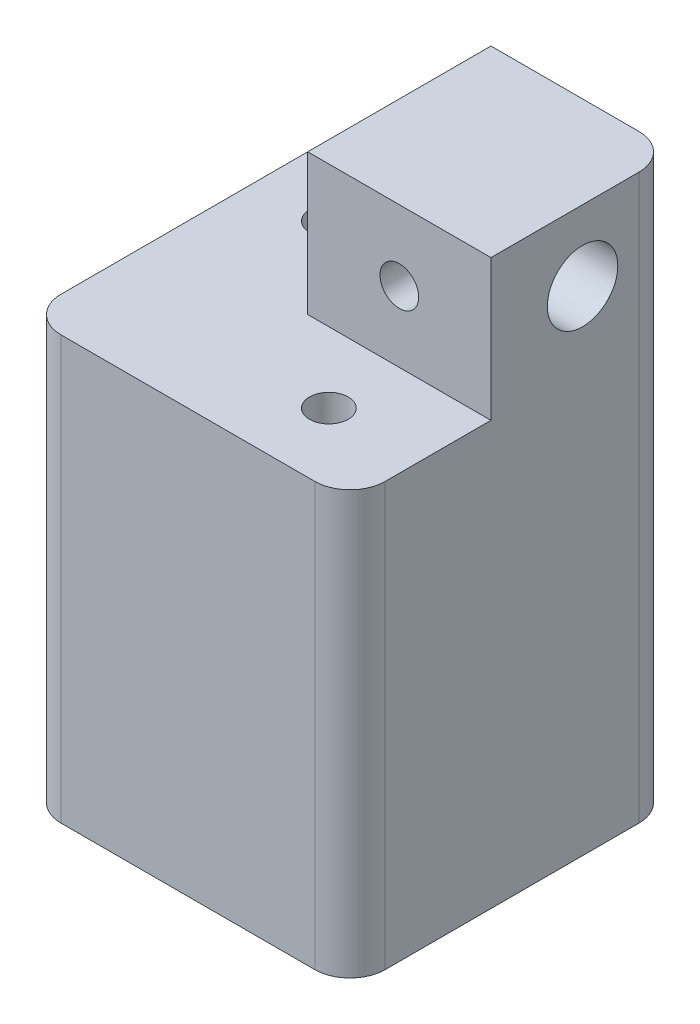
ISO-10303-21;
HEADER;
FILE_DESCRIPTION(('STEP AP214'),'2;1');
FILE_NAME('part.step','',(''),(''),'','','');
FILE_SCHEMA(('AUTOMOTIVE_DESIGN { 1 0 10303 214 1 1 1 1 }'));
ENDSEC;
DATA;
#1=APPLICATION_CONTEXT('core data for automotive mechanical design processes');
#2=APPLICATION_PROTOCOL_DEFINITION('international standard','automotive_design',2000,#1);
#3=PRODUCT_CONTEXT('',#1,'mechanical');
#4=PRODUCT('Part','Part','',(#3));
#5=PRODUCT_RELATED_PRODUCT_CATEGORY('part','',(#4));
#6=PRODUCT_DEFINITION_FORMATION('','',#4);
#7=PRODUCT_DEFINITION_CONTEXT('part definition',#1,'design');
#8=PRODUCT_DEFINITION('design','',#6,#7);
#9=PRODUCT_DEFINITION_SHAPE('','',#8);
#10=(LENGTH_UNIT() NAMED_UNIT(*) SI_UNIT(.MILLI.,.METRE.));
#11=(NAMED_UNIT(*) PLANE_ANGLE_UNIT() SI_UNIT($,.RADIAN.));
#12=(NAMED_UNIT(*) SI_UNIT($,.STERADIAN.) SOLID_ANGLE_UNIT());
#13=UNCERTAINTY_MEASURE_WITH_UNIT(LENGTH_MEASURE(1.E-05),#10,'distance_accuracy_value','');
#14=(GEOMETRIC_REPRESENTATION_CONTEXT(3) GLOBAL_UNCERTAINTY_ASSIGNED_CONTEXT((#13)) GLOBAL_UNIT_ASSIGNED_CONTEXT((#10,
#11,#12)) REPRESENTATION_CONTEXT('',''));
#15=CARTESIAN_POINT('',(0.,0.,0.));
#16=DIRECTION('',(0.,0.,1.));
#17=DIRECTION('',(1.,0.,0.));
#18=AXIS2_PLACEMENT_3D('',#15,#16,#17);
#19=CARTESIAN_POINT('',(10.,80.,-33.));
#20=DIRECTION('',(0.,-1.,0.));
#21=DIRECTION('',(0.,0.,-1.));
#22=AXIS2_PLACEMENT_3D('',#19,#20,#21);
#23=CYLINDRICAL_SURFACE('',#22,2.75);
#24=CARTESIAN_POINT('',(10.,60.,-33.));
#25=DIRECTION('',(0.,1.,0.));
#26=DIRECTION('',(0.,0.,1.));
#27=AXIS2_PLACEMENT_3D('',#24,#25,#26);
#28=CIRCLE('',#27,2.75);
#29=CARTESIAN_POINT('',(10.,60.,-30.25));
#30=VERTEX_POINT('',#29);
#31=EDGE_CURVE('E156',#30,#30,#28,.T.);
#32=ORIENTED_EDGE('',*,*,#31,.T.);
#33=EDGE_LOOP('',(#32));
#34=FACE_BOUND('',#33,.T.);
#35=CARTESIAN_POINT('',(10.,55.,-33.));
#36=DIRECTION('',(0.,-1.,0.));
#37=DIRECTION('',(0.,0.,-1.));
#38=AXIS2_PLACEMENT_3D('',#35,#36,#37);
#39=CIRCLE('',#38,2.75);
#40=CARTESIAN_POINT('',(10.,55.,-35.75));
#41=VERTEX_POINT('',#40);
#42=EDGE_CURVE('E36',#41,#41,#39,.F.);
#43=ORIENTED_EDGE('',*,*,#42,.F.);
#44=EDGE_LOOP('',(#43));
#45=FACE_BOUND('',#44,.T.);
#46=ADVANCED_FACE('F32',(#34,#45),#23,.F.);
#47=CARTESIAN_POINT('',(33.,0.,-10.));
#48=DIRECTION('',(0.,1.,0.));
#49=DIRECTION('',(0.,0.,1.));
#50=AXIS2_PLACEMENT_3D('',#47,#48,#49);
#51=CYLINDRICAL_SURFACE('',#50,2.75);
#52=CARTESIAN_POINT('',(33.,60.,-10.));
#53=DIRECTION('',(0.,1.,0.));
#54=DIRECTION('',(0.,0.,1.));
#55=AXIS2_PLACEMENT_3D('',#52,#53,#54);
#56=CIRCLE('',#55,2.75);
#57=CARTESIAN_POINT('',(33.,60.,-7.25));
#58=VERTEX_POINT('',#57);
#59=EDGE_CURVE('E188',#58,#58,#56,.T.);
#60=ORIENTED_EDGE('',*,*,#59,.T.);
#61=EDGE_LOOP('',(#60));
#62=FACE_BOUND('',#61,.T.);
#63=CARTESIAN_POINT('',(33.,55.,-10.));
#64=DIRECTION('',(0.,-1.,0.));
#65=DIRECTION('',(0.,0.,-1.));
#66=AXIS2_PLACEMENT_3D('',#63,#64,#65);
#67=CIRCLE('',#66,2.75);
#68=CARTESIAN_POINT('',(33.,55.,-12.75));
#69=VERTEX_POINT('',#68);
#70=EDGE_CURVE('E189',#69,#69,#67,.F.);
#71=ORIENTED_EDGE('',*,*,#70,.F.);
#72=EDGE_LOOP('',(#71));
#73=FACE_BOUND('',#72,.T.);
#74=ADVANCED_FACE('F328',(#62,#73),#51,.F.);
#75=CARTESIAN_POINT('',(25.,70.,-33.));
#76=DIRECTION('',(1.,0.,0.));
#77=DIRECTION('',(0.,0.,-1.));
#78=AXIS2_PLACEMENT_3D('',#75,#76,#77);
#79=CYLINDRICAL_SURFACE('',#78,4.99999999999999);
#80=CARTESIAN_POINT('',(46.,70.,-33.));
#81=DIRECTION('',(1.,0.,0.));
#82=DIRECTION('',(0.,0.,-1.));
#83=AXIS2_PLACEMENT_3D('',#80,#81,#82);
#84=CIRCLE('',#83,4.99999999999999);
#85=CARTESIAN_POINT('',(46.,70.,-38.));
#86=VERTEX_POINT('',#85);
#87=EDGE_CURVE('E219',#86,#86,#84,.T.);
#88=ORIENTED_EDGE('',*,*,#87,.T.);
#89=EDGE_LOOP('',(#88));
#90=FACE_BOUND('',#89,.T.);
#91=CARTESIAN_POINT('',(33.,70.,-33.));
#92=DIRECTION('',(0.707106781186547,0.,0.707106781186547));
#93=DIRECTION('',(0.707106781186547,0.,-0.707106781186547));
#94=AXIS2_PLACEMENT_3D('',#91,#92,#93);
#95=ELLIPSE('',#94,7.07106781186547,5.);
#96=CARTESIAN_POINT('',(33.,75.,-33.));
#97=VERTEX_POINT('',#96);
#98=CARTESIAN_POINT('',(33.,65.,-33.));
#99=VERTEX_POINT('',#98);
#100=EDGE_CURVE('E133',#97,#99,#95,.F.);
#101=ORIENTED_EDGE('',*,*,#100,.T.);
#102=CARTESIAN_POINT('',(33.,70.,-33.));
#103=DIRECTION('',(0.707106781186547,0.,-0.707106781186547));
#104=DIRECTION('',(0.707106781186547,0.,0.707106781186547));
#105=AXIS2_PLACEMENT_3D('',#102,#103,#104);
#106=ELLIPSE('',#105,7.07106781186547,5.);
#107=EDGE_CURVE('E129',#99,#97,#106,.F.);
#108=ORIENTED_EDGE('',*,*,#107,.T.);
#109=EDGE_LOOP('',(#101,#108));
#110=FACE_BOUND('',#109,.T.);
#111=ADVANCED_FACE('F141',(#90,#110),#79,.F.);
#112=CARTESIAN_POINT('',(0.,80.,0.));
#113=DIRECTION('',(1.,0.,0.));
#114=DIRECTION('',(0.,0.,-1.));
#115=AXIS2_PLACEMENT_3D('',#112,#113,#114);
#116=PLANE('',#115);
#117=DIRECTION('',(0.,0.,1.));
#118=VECTOR('',#117,1.);
#119=CARTESIAN_POINT('',(0.,60.,-46.));
#120=LINE('',#119,#118);
#121=CARTESIAN_POINT('',(0.,60.,-41.));
#122=VERTEX_POINT('',#121);
#123=CARTESIAN_POINT('',(0.,60.,-5.));
#124=VERTEX_POINT('',#123);
#125=EDGE_CURVE('E228',#122,#124,#120,.T.);
#126=ORIENTED_EDGE('',*,*,#125,.F.);
#127=DIRECTION('',(0.,-1.,0.));
#128=VECTOR('',#127,1.);
#129=CARTESIAN_POINT('',(0.,80.,-41.));
#130=LINE('',#129,#128);
#131=CARTESIAN_POINT('',(0.,0.,-41.));
#132=VERTEX_POINT('',#131);
#133=EDGE_CURVE('E158',#122,#132,#130,.T.);
#134=ORIENTED_EDGE('',*,*,#133,.T.);
#135=DIRECTION('',(0.,0.,1.));
#136=VECTOR('',#135,1.);
#137=CARTESIAN_POINT('',(0.,0.,0.));
#138=LINE('',#137,#136);
#139=CARTESIAN_POINT('',(0.,0.,-5.));
#140=VERTEX_POINT('',#139);
#141=EDGE_CURVE('E253',#132,#140,#138,.T.);
#142=ORIENTED_EDGE('',*,*,#141,.T.);
#143=DIRECTION('',(0.,-1.,0.));
#144=VECTOR('',#143,1.);
#145=CARTESIAN_POINT('',(0.,80.,-5.));
#146=LINE('',#145,#144);
#147=EDGE_CURVE('E142',#140,#124,#146,.F.);
#148=ORIENTED_EDGE('',*,*,#147,.T.);
#149=EDGE_LOOP('',(#126,#134,#142,#148));
#150=FACE_BOUND('',#149,.T.);
#151=ADVANCED_FACE('F285',(#150),#116,.F.);
#152=CARTESIAN_POINT('',(0.,80.,0.));
#153=DIRECTION('',(0.,0.,-1.));
#154=DIRECTION('',(-1.,0.,0.));
#155=AXIS2_PLACEMENT_3D('',#152,#153,#154);
#156=PLANE('',#155);
#157=DIRECTION('',(1.,0.,0.));
#158=VECTOR('',#157,1.);
#159=CARTESIAN_POINT('',(0.,60.,0.));
#160=LINE('',#159,#158);
#161=CARTESIAN_POINT('',(5.,60.,0.));
#162=VERTEX_POINT('',#161);
#163=CARTESIAN_POINT('',(41.,60.,0.));
#164=VERTEX_POINT('',#163);
#165=EDGE_CURVE('E231',#162,#164,#160,.T.);
#166=ORIENTED_EDGE('',*,*,#165,.F.);
#167=DIRECTION('',(0.,-1.,0.));
#168=VECTOR('',#167,1.);
#169=CARTESIAN_POINT('',(5.,80.,0.));
#170=LINE('',#169,#168);
#171=CARTESIAN_POINT('',(5.,0.,0.));
#172=VERTEX_POINT('',#171);
#173=EDGE_CURVE('E181',#162,#172,#170,.T.);
#174=ORIENTED_EDGE('',*,*,#173,.T.);
#175=DIRECTION('',(1.,0.,0.));
#176=VECTOR('',#175,1.);
#177=CARTESIAN_POINT('',(0.,0.,0.));
#178=LINE('',#177,#176);
#179=CARTESIAN_POINT('',(41.,0.,0.));
#180=VERTEX_POINT('',#179);
#181=EDGE_CURVE('E263',#172,#180,#178,.T.);
#182=ORIENTED_EDGE('',*,*,#181,.T.);
#183=DIRECTION('',(0.,-1.,0.));
#184=VECTOR('',#183,1.);
#185=CARTESIAN_POINT('',(41.,80.,0.));
#186=LINE('',#185,#184);
#187=EDGE_CURVE('E179',#180,#164,#186,.F.);
#188=ORIENTED_EDGE('',*,*,#187,.T.);
#189=EDGE_LOOP('',(#166,#174,#182,#188));
#190=FACE_BOUND('',#189,.T.);
#191=ADVANCED_FACE('F293',(#190),#156,.F.);
#192=CARTESIAN_POINT('',(46.,80.,0.));
#193=DIRECTION('',(-1.,0.,0.));
#194=DIRECTION('',(0.,0.,1.));
#195=AXIS2_PLACEMENT_3D('',#192,#193,#194);
#196=PLANE('',#195);
#197=ORIENTED_EDGE('',*,*,#87,.F.);
#198=EDGE_LOOP('',(#197));
#199=FACE_BOUND('',#198,.T.);
#200=DIRECTION('',(0.,0.,-1.));
#201=VECTOR('',#200,1.);
#202=CARTESIAN_POINT('',(46.,60.,0.));
#203=LINE('',#202,#201);
#204=CARTESIAN_POINT('',(46.,60.,-5.));
#205=VERTEX_POINT('',#204);
#206=CARTESIAN_POINT('',(46.,60.,-20.));
#207=VERTEX_POINT('',#206);
#208=EDGE_CURVE('E234',#205,#207,#203,.T.);
#209=ORIENTED_EDGE('',*,*,#208,.F.);
#210=DIRECTION('',(0.,-1.,0.));
#211=VECTOR('',#210,1.);
#212=CARTESIAN_POINT('',(46.,80.,-5.));
#213=LINE('',#212,#211);
#214=CARTESIAN_POINT('',(46.,0.,-5.));
#215=VERTEX_POINT('',#214);
#216=EDGE_CURVE('E41',#205,#215,#213,.T.);
#217=ORIENTED_EDGE('',*,*,#216,.T.);
#218=DIRECTION('',(0.,0.,-1.));
#219=VECTOR('',#218,1.);
#220=CARTESIAN_POINT('',(46.,0.,0.));
#221=LINE('',#220,#219);
#222=CARTESIAN_POINT('',(46.,0.,-41.));
#223=VERTEX_POINT('',#222);
#224=EDGE_CURVE('E266',#215,#223,#221,.T.);
#225=ORIENTED_EDGE('',*,*,#224,.T.);
#226=DIRECTION('',(0.,-1.,0.));
#227=VECTOR('',#226,1.);
#228=CARTESIAN_POINT('',(46.,80.,-41.));
#229=LINE('',#228,#227);
#230=CARTESIAN_POINT('',(46.,80.,-41.));
#231=VERTEX_POINT('',#230);
#232=EDGE_CURVE('E49',#223,#231,#229,.F.);
#233=ORIENTED_EDGE('',*,*,#232,.T.);
#234=DIRECTION('',(0.,0.,-1.));
#235=VECTOR('',#234,1.);
#236=CARTESIAN_POINT('',(46.,80.,0.));
#237=LINE('',#236,#235);
#238=CARTESIAN_POINT('',(46.,80.,-20.));
#239=VERTEX_POINT('',#238);
#240=EDGE_CURVE('E257',#239,#231,#237,.T.);
#241=ORIENTED_EDGE('',*,*,#240,.F.);
#242=DIRECTION('',(0.,1.,0.));
#243=VECTOR('',#242,1.);
#244=CARTESIAN_POINT('',(46.,60.,-20.));
#245=LINE('',#244,#243);
#246=EDGE_CURVE('E245',#207,#239,#245,.T.);
#247=ORIENTED_EDGE('',*,*,#246,.F.);
#248=EDGE_LOOP('',(#209,#217,#225,#233,#241,#247));
#249=FACE_BOUND('',#248,.T.);
#250=ADVANCED_FACE('F300',(#199,#249),#196,.F.);
#251=CARTESIAN_POINT('',(0.,80.,-46.));
#252=DIRECTION('',(0.,0.,1.));
#253=DIRECTION('',(1.,0.,0.));
#254=AXIS2_PLACEMENT_3D('',#251,#252,#253);
#255=PLANE('',#254);
#256=CARTESIAN_POINT('',(33.,70.,-46.));
#257=DIRECTION('',(0.,0.,-1.));
#258=DIRECTION('',(-1.,0.,0.));
#259=AXIS2_PLACEMENT_3D('',#256,#257,#258);
#260=CIRCLE('',#259,5.);
#261=CARTESIAN_POINT('',(28.,70.,-46.));
#262=VERTEX_POINT('',#261);
#263=EDGE_CURVE('E215',#262,#262,#260,.T.);
#264=ORIENTED_EDGE('',*,*,#263,.F.);
#265=EDGE_LOOP('',(#264));
#266=FACE_BOUND('',#265,.T.);
#267=DIRECTION('',(-1.,0.,0.));
#268=VECTOR('',#267,1.);
#269=CARTESIAN_POINT('',(0.,0.,-46.));
#270=LINE('',#269,#268);
#271=CARTESIAN_POINT('',(41.,0.,-46.));
#272=VERTEX_POINT('',#271);
#273=CARTESIAN_POINT('',(4.99999999999999,0.,-46.));
#274=VERTEX_POINT('',#273);
#275=EDGE_CURVE('E259',#272,#274,#270,.T.);
#276=ORIENTED_EDGE('',*,*,#275,.T.);
#277=DIRECTION('',(0.,-1.,0.));
#278=VECTOR('',#277,1.);
#279=CARTESIAN_POINT('',(4.99999999999999,80.,-46.));
#280=LINE('',#279,#278);
#281=CARTESIAN_POINT('',(4.99999999999999,60.,-46.));
#282=VERTEX_POINT('',#281);
#283=EDGE_CURVE('E172',#274,#282,#280,.F.);
#284=ORIENTED_EDGE('',*,*,#283,.T.);
#285=DIRECTION('',(-1.,0.,0.));
#286=VECTOR('',#285,1.);
#287=CARTESIAN_POINT('',(0.,60.,-46.));
#288=LINE('',#287,#286);
#289=CARTESIAN_POINT('',(20.,60.,-46.));
#290=VERTEX_POINT('',#289);
#291=EDGE_CURVE('E242',#290,#282,#288,.T.);
#292=ORIENTED_EDGE('',*,*,#291,.F.);
#293=DIRECTION('',(0.,1.,0.));
#294=VECTOR('',#293,1.);
#295=CARTESIAN_POINT('',(20.,60.,-46.));
#296=LINE('',#295,#294);
#297=CARTESIAN_POINT('',(20.,80.,-46.));
#298=VERTEX_POINT('',#297);
#299=EDGE_CURVE('E250',#290,#298,#296,.T.);
#300=ORIENTED_EDGE('',*,*,#299,.T.);
#301=DIRECTION('',(-1.,0.,0.));
#302=VECTOR('',#301,1.);
#303=CARTESIAN_POINT('',(0.,80.,-46.));
#304=LINE('',#303,#302);
#305=CARTESIAN_POINT('',(41.,80.,-46.));
#306=VERTEX_POINT('',#305);
#307=EDGE_CURVE('E139',#306,#298,#304,.T.);
#308=ORIENTED_EDGE('',*,*,#307,.F.);
#309=DIRECTION('',(0.,-1.,0.));
#310=VECTOR('',#309,1.);
#311=CARTESIAN_POINT('',(41.,80.,-46.));
#312=LINE('',#311,#310);
#313=EDGE_CURVE('E169',#306,#272,#312,.T.);
#314=ORIENTED_EDGE('',*,*,#313,.T.);
#315=EDGE_LOOP('',(#276,#284,#292,#300,#308,#314));
#316=FACE_BOUND('',#315,.T.);
#317=ADVANCED_FACE('F272',(#266,#316),#255,.F.);
#318=CARTESIAN_POINT('',(0.,80.,0.));
#319=DIRECTION('',(0.,-1.,0.));
#320=DIRECTION('',(0.,0.,-1.));
#321=AXIS2_PLACEMENT_3D('',#318,#319,#320);
#322=PLANE('',#321);
#323=ORIENTED_EDGE('',*,*,#240,.T.);
#324=CARTESIAN_POINT('',(41.,80.,-41.));
#325=DIRECTION('',(0.,-1.,0.));
#326=DIRECTION('',(0.,0.,-1.));
#327=AXIS2_PLACEMENT_3D('',#324,#325,#326);
#328=CIRCLE('',#327,5.);
#329=EDGE_CURVE('E11',#231,#306,#328,.F.);
#330=ORIENTED_EDGE('',*,*,#329,.T.);
#331=ORIENTED_EDGE('',*,*,#307,.T.);
#332=DIRECTION('',(0.,0.,-1.));
#333=VECTOR('',#332,1.);
#334=CARTESIAN_POINT('',(20.,80.,-46.));
#335=LINE('',#334,#333);
#336=CARTESIAN_POINT('',(20.,80.,-20.));
#337=VERTEX_POINT('',#336);
#338=EDGE_CURVE('E232',#337,#298,#335,.T.);
#339=ORIENTED_EDGE('',*,*,#338,.F.);
#340=DIRECTION('',(-1.,0.,0.));
#341=VECTOR('',#340,1.);
#342=CARTESIAN_POINT('',(20.,80.,-20.));
#343=LINE('',#342,#341);
#344=EDGE_CURVE('E225',#239,#337,#343,.T.);
#345=ORIENTED_EDGE('',*,*,#344,.F.);
#346=EDGE_LOOP('',(#323,#330,#331,#339,#345));
#347=FACE_BOUND('',#346,.T.);
#348=ADVANCED_FACE('F306',(#347),#322,.F.);
#349=CARTESIAN_POINT('',(0.,0.,0.));
#350=DIRECTION('',(0.,-1.,0.));
#351=DIRECTION('',(0.,0.,-1.));
#352=AXIS2_PLACEMENT_3D('',#349,#350,#351);
#353=PLANE('',#352);
#354=CARTESIAN_POINT('',(33.,0.,-10.));
#355=DIRECTION('',(0.,-1.,0.));
#356=DIRECTION('',(0.,0.,-1.));
#357=AXIS2_PLACEMENT_3D('',#354,#355,#356);
#358=CIRCLE('',#357,5.);
#359=CARTESIAN_POINT('',(33.,0.,-15.));
#360=VERTEX_POINT('',#359);
#361=EDGE_CURVE('E196',#360,#360,#358,.T.);
#362=ORIENTED_EDGE('',*,*,#361,.F.);
#363=EDGE_LOOP('',(#362));
#364=FACE_BOUND('',#363,.T.);
#365=CARTESIAN_POINT('',(10.,0.,-33.));
#366=DIRECTION('',(0.,-1.,0.));
#367=DIRECTION('',(0.,0.,-1.));
#368=AXIS2_PLACEMENT_3D('',#365,#366,#367);
#369=CIRCLE('',#368,5.);
#370=CARTESIAN_POINT('',(10.,0.,-38.));
#371=VERTEX_POINT('',#370);
#372=EDGE_CURVE('E206',#371,#371,#369,.T.);
#373=ORIENTED_EDGE('',*,*,#372,.F.);
#374=EDGE_LOOP('',(#373));
#375=FACE_BOUND('',#374,.T.);
#376=ORIENTED_EDGE('',*,*,#141,.F.);
#377=CARTESIAN_POINT('',(4.99999999999999,0.,-41.));
#378=DIRECTION('',(0.,-1.,0.));
#379=DIRECTION('',(0.,0.,-1.));
#380=AXIS2_PLACEMENT_3D('',#377,#378,#379);
#381=CIRCLE('',#380,5.);
#382=EDGE_CURVE('E167',#132,#274,#381,.T.);
#383=ORIENTED_EDGE('',*,*,#382,.T.);
#384=ORIENTED_EDGE('',*,*,#275,.F.);
#385=CARTESIAN_POINT('',(41.,0.,-41.));
#386=DIRECTION('',(0.,-1.,0.));
#387=DIRECTION('',(0.,0.,-1.));
#388=AXIS2_PLACEMENT_3D('',#385,#386,#387);
#389=CIRCLE('',#388,5.);
#390=EDGE_CURVE('E161',#272,#223,#389,.T.);
#391=ORIENTED_EDGE('',*,*,#390,.T.);
#392=ORIENTED_EDGE('',*,*,#224,.F.);
#393=CARTESIAN_POINT('',(41.,0.,-5.));
#394=DIRECTION('',(0.,-1.,0.));
#395=DIRECTION('',(0.,0.,-1.));
#396=AXIS2_PLACEMENT_3D('',#393,#394,#395);
#397=CIRCLE('',#396,5.);
#398=EDGE_CURVE('E163',#215,#180,#397,.T.);
#399=ORIENTED_EDGE('',*,*,#398,.T.);
#400=ORIENTED_EDGE('',*,*,#181,.F.);
#401=CARTESIAN_POINT('',(5.,0.,-5.));
#402=DIRECTION('',(0.,-1.,0.));
#403=DIRECTION('',(0.,0.,-1.));
#404=AXIS2_PLACEMENT_3D('',#401,#402,#403);
#405=CIRCLE('',#404,5.);
#406=EDGE_CURVE('E165',#172,#140,#405,.T.);
#407=ORIENTED_EDGE('',*,*,#406,.T.);
#408=EDGE_LOOP('',(#376,#383,#384,#391,#392,#399,#400,#407));
#409=FACE_BOUND('',#408,.T.);
#410=ADVANCED_FACE('F302',(#364,#375,#409),#353,.T.);
#411=CARTESIAN_POINT('',(20.,60.,-46.));
#412=DIRECTION('',(1.,0.,0.));
#413=DIRECTION('',(0.,0.,-1.));
#414=AXIS2_PLACEMENT_3D('',#411,#412,#413);
#415=PLANE('',#414);
#416=CARTESIAN_POINT('',(20.,70.,-33.));
#417=DIRECTION('',(1.,0.,0.));
#418=DIRECTION('',(0.,0.,-1.));
#419=AXIS2_PLACEMENT_3D('',#416,#417,#418);
#420=CIRCLE('',#419,2.75);
#421=CARTESIAN_POINT('',(20.,70.,-35.75));
#422=VERTEX_POINT('',#421);
#423=EDGE_CURVE('E152',#422,#422,#420,.T.);
#424=ORIENTED_EDGE('',*,*,#423,.T.);
#425=EDGE_LOOP('',(#424));
#426=FACE_BOUND('',#425,.T.);
#427=ORIENTED_EDGE('',*,*,#338,.T.);
#428=ORIENTED_EDGE('',*,*,#299,.F.);
#429=DIRECTION('',(0.,0.,-1.));
#430=VECTOR('',#429,1.);
#431=CARTESIAN_POINT('',(20.,60.,-46.));
#432=LINE('',#431,#430);
#433=CARTESIAN_POINT('',(20.,60.,-20.));
#434=VERTEX_POINT('',#433);
#435=EDGE_CURVE('E239',#434,#290,#432,.T.);
#436=ORIENTED_EDGE('',*,*,#435,.F.);
#437=DIRECTION('',(0.,1.,0.));
#438=VECTOR('',#437,1.);
#439=CARTESIAN_POINT('',(20.,60.,-20.));
#440=LINE('',#439,#438);
#441=EDGE_CURVE('E254',#434,#337,#440,.T.);
#442=ORIENTED_EDGE('',*,*,#441,.T.);
#443=EDGE_LOOP('',(#427,#428,#436,#442));
#444=FACE_BOUND('',#443,.T.);
#445=ADVANCED_FACE('F311',(#426,#444),#415,.F.);
#446=CARTESIAN_POINT('',(20.,60.,-20.));
#447=DIRECTION('',(0.,0.,-1.));
#448=DIRECTION('',(-1.,0.,0.));
#449=AXIS2_PLACEMENT_3D('',#446,#447,#448);
#450=PLANE('',#449);
#451=CARTESIAN_POINT('',(33.,70.,-20.));
#452=DIRECTION('',(0.,0.,-1.));
#453=DIRECTION('',(-1.,0.,0.));
#454=AXIS2_PLACEMENT_3D('',#451,#452,#453);
#455=CIRCLE('',#454,2.75);
#456=CARTESIAN_POINT('',(30.25,70.,-20.));
#457=VERTEX_POINT('',#456);
#458=EDGE_CURVE('E151',#457,#457,#455,.T.);
#459=ORIENTED_EDGE('',*,*,#458,.T.);
#460=EDGE_LOOP('',(#459));
#461=FACE_BOUND('',#460,.T.);
#462=ORIENTED_EDGE('',*,*,#344,.T.);
#463=ORIENTED_EDGE('',*,*,#441,.F.);
#464=DIRECTION('',(-1.,0.,0.));
#465=VECTOR('',#464,1.);
#466=CARTESIAN_POINT('',(20.,60.,-20.));
#467=LINE('',#466,#465);
#468=EDGE_CURVE('E236',#207,#434,#467,.T.);
#469=ORIENTED_EDGE('',*,*,#468,.F.);
#470=ORIENTED_EDGE('',*,*,#246,.T.);
#471=EDGE_LOOP('',(#462,#463,#469,#470));
#472=FACE_BOUND('',#471,.T.);
#473=ADVANCED_FACE('F314',(#461,#472),#450,.F.);
#474=CARTESIAN_POINT('',(0.,60.,0.));
#475=DIRECTION('',(0.,1.,0.));
#476=DIRECTION('',(0.,0.,1.));
#477=AXIS2_PLACEMENT_3D('',#474,#475,#476);
#478=PLANE('',#477);
#479=ORIENTED_EDGE('',*,*,#59,.F.);
#480=EDGE_LOOP('',(#479));
#481=FACE_BOUND('',#480,.T.);
#482=ORIENTED_EDGE('',*,*,#31,.F.);
#483=EDGE_LOOP('',(#482));
#484=FACE_BOUND('',#483,.T.);
#485=ORIENTED_EDGE('',*,*,#291,.T.);
#486=CARTESIAN_POINT('',(4.99999999999999,60.,-41.));
#487=DIRECTION('',(0.,1.,0.));
#488=DIRECTION('',(0.,0.,1.));
#489=AXIS2_PLACEMENT_3D('',#486,#487,#488);
#490=CIRCLE('',#489,5.);
#491=EDGE_CURVE('E177',#282,#122,#490,.T.);
#492=ORIENTED_EDGE('',*,*,#491,.T.);
#493=ORIENTED_EDGE('',*,*,#125,.T.);
#494=CARTESIAN_POINT('',(5.,60.,-5.));
#495=DIRECTION('',(0.,1.,0.));
#496=DIRECTION('',(0.,0.,1.));
#497=AXIS2_PLACEMENT_3D('',#494,#495,#496);
#498=CIRCLE('',#497,5.);
#499=EDGE_CURVE('E175',#124,#162,#498,.T.);
#500=ORIENTED_EDGE('',*,*,#499,.T.);
#501=ORIENTED_EDGE('',*,*,#165,.T.);
#502=CARTESIAN_POINT('',(41.,60.,-5.));
#503=DIRECTION('',(0.,1.,0.));
#504=DIRECTION('',(0.,0.,1.));
#505=AXIS2_PLACEMENT_3D('',#502,#503,#504);
#506=CIRCLE('',#505,5.);
#507=EDGE_CURVE('E57',#164,#205,#506,.T.);
#508=ORIENTED_EDGE('',*,*,#507,.T.);
#509=ORIENTED_EDGE('',*,*,#208,.T.);
#510=ORIENTED_EDGE('',*,*,#468,.T.);
#511=ORIENTED_EDGE('',*,*,#435,.T.);
#512=EDGE_LOOP('',(#485,#492,#493,#500,#501,#508,#509,#510,#511));
#513=FACE_BOUND('',#512,.T.);
#514=ADVANCED_FACE('F282',(#481,#484,#513),#478,.T.);
#515=CARTESIAN_POINT('',(33.,70.,-25.));
#516=DIRECTION('',(0.,0.,-1.));
#517=DIRECTION('',(-1.,0.,0.));
#518=AXIS2_PLACEMENT_3D('',#515,#516,#517);
#519=CYLINDRICAL_SURFACE('',#518,5.);
#520=ORIENTED_EDGE('',*,*,#263,.T.);
#521=EDGE_LOOP('',(#520));
#522=FACE_BOUND('',#521,.T.);
#523=ORIENTED_EDGE('',*,*,#100,.F.);
#524=CARTESIAN_POINT('',(33.,70.,-33.));
#525=DIRECTION('',(0.707106781186547,0.,-0.707106781186547));
#526=DIRECTION('',(0.707106781186547,0.,0.707106781186547));
#527=AXIS2_PLACEMENT_3D('',#524,#525,#526);
#528=ELLIPSE('',#527,7.07106781186547,5.);
#529=EDGE_CURVE('E132',#99,#97,#528,.T.);
#530=ORIENTED_EDGE('',*,*,#529,.F.);
#531=EDGE_LOOP('',(#523,#530));
#532=FACE_BOUND('',#531,.T.);
#533=ADVANCED_FACE('F137',(#522,#532),#519,.F.);
#534=CARTESIAN_POINT('',(25.,70.,-33.));
#535=DIRECTION('',(1.,0.,0.));
#536=DIRECTION('',(0.,0.,-1.));
#537=AXIS2_PLACEMENT_3D('',#534,#535,#536);
#538=PLANE('',#537);
#539=CARTESIAN_POINT('',(25.,70.,-33.));
#540=DIRECTION('',(1.,0.,0.));
#541=DIRECTION('',(0.,0.,-1.));
#542=AXIS2_PLACEMENT_3D('',#539,#540,#541);
#543=CIRCLE('',#542,2.75);
#544=CARTESIAN_POINT('',(25.,70.,-35.75));
#545=VERTEX_POINT('',#544);
#546=EDGE_CURVE('E153',#545,#545,#543,.T.);
#547=ORIENTED_EDGE('',*,*,#546,.F.);
#548=EDGE_LOOP('',(#547));
#549=FACE_BOUND('',#548,.T.);
#550=CARTESIAN_POINT('',(25.,70.,-33.));
#551=DIRECTION('',(1.,0.,0.));
#552=DIRECTION('',(0.,0.,-1.));
#553=AXIS2_PLACEMENT_3D('',#550,#551,#552);
#554=CIRCLE('',#553,4.99999999999999);
#555=CARTESIAN_POINT('',(25.,70.,-38.));
#556=VERTEX_POINT('',#555);
#557=EDGE_CURVE('E222',#556,#556,#554,.T.);
#558=ORIENTED_EDGE('',*,*,#557,.T.);
#559=EDGE_LOOP('',(#558));
#560=FACE_BOUND('',#559,.T.);
#561=ADVANCED_FACE('F354',(#549,#560),#538,.T.);
#562=CARTESIAN_POINT('',(33.,70.,-33.));
#563=DIRECTION('',(0.707106781186547,0.,0.707106781186547));
#564=DIRECTION('',(0.707106781186547,0.,-0.707106781186547));
#565=AXIS2_PLACEMENT_3D('',#562,#563,#564);
#566=ELLIPSE('',#565,7.07106781186547,5.);
#567=EDGE_CURVE('E125',#97,#99,#566,.T.);
#568=ORIENTED_EDGE('',*,*,#567,.T.);
#569=ORIENTED_EDGE('',*,*,#529,.T.);
#570=EDGE_LOOP('',(#568,#569));
#571=FACE_BOUND('',#570,.T.);
#572=ORIENTED_EDGE('',*,*,#557,.F.);
#573=EDGE_LOOP('',(#572));
#574=FACE_BOUND('',#573,.T.);
#575=ADVANCED_FACE('F144',(#571,#574),#79,.F.);
#576=CARTESIAN_POINT('',(33.,70.,-25.));
#577=DIRECTION('',(0.,0.,-1.));
#578=DIRECTION('',(-1.,0.,0.));
#579=AXIS2_PLACEMENT_3D('',#576,#577,#578);
#580=CIRCLE('',#579,5.);
#581=CARTESIAN_POINT('',(28.,70.,-25.));
#582=VERTEX_POINT('',#581);
#583=EDGE_CURVE('E216',#582,#582,#580,.T.);
#584=ORIENTED_EDGE('',*,*,#583,.F.);
#585=EDGE_LOOP('',(#584));
#586=FACE_BOUND('',#585,.T.);
#587=ORIENTED_EDGE('',*,*,#567,.F.);
#588=ORIENTED_EDGE('',*,*,#107,.F.);
#589=EDGE_LOOP('',(#587,#588));
#590=FACE_BOUND('',#589,.T.);
#591=ADVANCED_FACE('F127',(#586,#590),#519,.F.);
#592=CARTESIAN_POINT('',(33.,70.,-25.));
#593=DIRECTION('',(0.,0.,-1.));
#594=DIRECTION('',(-1.,0.,0.));
#595=AXIS2_PLACEMENT_3D('',#592,#593,#594);
#596=PLANE('',#595);
#597=CARTESIAN_POINT('',(33.,70.,-25.));
#598=DIRECTION('',(0.,0.,-1.));
#599=DIRECTION('',(-1.,0.,0.));
#600=AXIS2_PLACEMENT_3D('',#597,#598,#599);
#601=CIRCLE('',#600,2.75);
#602=CARTESIAN_POINT('',(30.25,70.,-25.));
#603=VERTEX_POINT('',#602);
#604=EDGE_CURVE('E148',#603,#603,#601,.T.);
#605=ORIENTED_EDGE('',*,*,#604,.F.);
#606=EDGE_LOOP('',(#605));
#607=FACE_BOUND('',#606,.T.);
#608=ORIENTED_EDGE('',*,*,#583,.T.);
#609=EDGE_LOOP('',(#608));
#610=FACE_BOUND('',#609,.T.);
#611=ADVANCED_FACE('F346',(#607,#610),#596,.T.);
#612=CARTESIAN_POINT('',(33.,70.,0.));
#613=DIRECTION('',(0.,0.,-1.));
#614=DIRECTION('',(-1.,0.,0.));
#615=AXIS2_PLACEMENT_3D('',#612,#613,#614);
#616=CYLINDRICAL_SURFACE('',#615,2.75);
#617=ORIENTED_EDGE('',*,*,#604,.T.);
#618=EDGE_LOOP('',(#617));
#619=FACE_BOUND('',#618,.T.);
#620=ORIENTED_EDGE('',*,*,#458,.F.);
#621=EDGE_LOOP('',(#620));
#622=FACE_BOUND('',#621,.T.);
#623=ADVANCED_FACE('F342',(#619,#622),#616,.F.);
#624=CARTESIAN_POINT('',(0.,70.,-33.));
#625=DIRECTION('',(1.,0.,0.));
#626=DIRECTION('',(0.,0.,-1.));
#627=AXIS2_PLACEMENT_3D('',#624,#625,#626);
#628=CYLINDRICAL_SURFACE('',#627,2.75);
#629=ORIENTED_EDGE('',*,*,#546,.T.);
#630=EDGE_LOOP('',(#629));
#631=FACE_BOUND('',#630,.T.);
#632=ORIENTED_EDGE('',*,*,#423,.F.);
#633=EDGE_LOOP('',(#632));
#634=FACE_BOUND('',#633,.T.);
#635=ADVANCED_FACE('F339',(#631,#634),#628,.F.);
#636=CARTESIAN_POINT('',(4.99999999999999,80.,-41.));
#637=DIRECTION('',(0.,-1.,0.));
#638=DIRECTION('',(0.,0.,-1.));
#639=AXIS2_PLACEMENT_3D('',#636,#637,#638);
#640=CYLINDRICAL_SURFACE('',#639,5.);
#641=ORIENTED_EDGE('',*,*,#491,.F.);
#642=ORIENTED_EDGE('',*,*,#283,.F.);
#643=ORIENTED_EDGE('',*,*,#382,.F.);
#644=ORIENTED_EDGE('',*,*,#133,.F.);
#645=EDGE_LOOP('',(#641,#642,#643,#644));
#646=FACE_BOUND('',#645,.T.);
#647=ADVANCED_FACE('F279',(#646),#640,.T.);
#648=CARTESIAN_POINT('',(5.,80.,-5.));
#649=DIRECTION('',(0.,-1.,0.));
#650=DIRECTION('',(0.,0.,-1.));
#651=AXIS2_PLACEMENT_3D('',#648,#649,#650);
#652=CYLINDRICAL_SURFACE('',#651,5.);
#653=ORIENTED_EDGE('',*,*,#499,.F.);
#654=ORIENTED_EDGE('',*,*,#147,.F.);
#655=ORIENTED_EDGE('',*,*,#406,.F.);
#656=ORIENTED_EDGE('',*,*,#173,.F.);
#657=EDGE_LOOP('',(#653,#654,#655,#656));
#658=FACE_BOUND('',#657,.T.);
#659=ADVANCED_FACE('F289',(#658),#652,.T.);
#660=CARTESIAN_POINT('',(41.,80.,-5.));
#661=DIRECTION('',(0.,-1.,0.));
#662=DIRECTION('',(0.,0.,-1.));
#663=AXIS2_PLACEMENT_3D('',#660,#661,#662);
#664=CYLINDRICAL_SURFACE('',#663,5.);
#665=ORIENTED_EDGE('',*,*,#507,.F.);
#666=ORIENTED_EDGE('',*,*,#187,.F.);
#667=ORIENTED_EDGE('',*,*,#398,.F.);
#668=ORIENTED_EDGE('',*,*,#216,.F.);
#669=EDGE_LOOP('',(#665,#666,#667,#668));
#670=FACE_BOUND('',#669,.T.);
#671=ADVANCED_FACE('F297',(#670),#664,.T.);
#672=CARTESIAN_POINT('',(41.,80.,-41.));
#673=DIRECTION('',(0.,-1.,0.));
#674=DIRECTION('',(0.,0.,-1.));
#675=AXIS2_PLACEMENT_3D('',#672,#673,#674);
#676=CYLINDRICAL_SURFACE('',#675,5.);
#677=ORIENTED_EDGE('',*,*,#329,.F.);
#678=ORIENTED_EDGE('',*,*,#232,.F.);
#679=ORIENTED_EDGE('',*,*,#390,.F.);
#680=ORIENTED_EDGE('',*,*,#313,.F.);
#681=EDGE_LOOP('',(#677,#678,#679,#680));
#682=FACE_BOUND('',#681,.T.);
#683=ADVANCED_FACE('F34',(#682),#676,.T.);
#684=CARTESIAN_POINT('',(33.,55.,-10.));
#685=DIRECTION('',(0.,-1.,0.));
#686=DIRECTION('',(0.,0.,-1.));
#687=AXIS2_PLACEMENT_3D('',#684,#685,#686);
#688=PLANE('',#687);
#689=CARTESIAN_POINT('',(33.,55.,-10.));
#690=DIRECTION('',(0.,-1.,0.));
#691=DIRECTION('',(0.,0.,-1.));
#692=AXIS2_PLACEMENT_3D('',#689,#690,#691);
#693=CIRCLE('',#692,5.);
#694=CARTESIAN_POINT('',(33.,55.,-15.));
#695=VERTEX_POINT('',#694);
#696=EDGE_CURVE('E191',#695,#695,#693,.T.);
#697=ORIENTED_EDGE('',*,*,#696,.T.);
#698=EDGE_LOOP('',(#697));
#699=FACE_BOUND('',#698,.T.);
#700=ORIENTED_EDGE('',*,*,#70,.T.);
#701=EDGE_LOOP('',(#700));
#702=FACE_BOUND('',#701,.T.);
#703=ADVANCED_FACE('F387',(#699,#702),#688,.T.);
#704=CARTESIAN_POINT('',(33.,55.,-10.));
#705=DIRECTION('',(0.,-1.,0.));
#706=DIRECTION('',(0.,0.,-1.));
#707=AXIS2_PLACEMENT_3D('',#704,#705,#706);
#708=CYLINDRICAL_SURFACE('',#707,5.);
#709=ORIENTED_EDGE('',*,*,#696,.F.);
#710=EDGE_LOOP('',(#709));
#711=FACE_BOUND('',#710,.T.);
#712=ORIENTED_EDGE('',*,*,#361,.T.);
#713=EDGE_LOOP('',(#712));
#714=FACE_BOUND('',#713,.T.);
#715=ADVANCED_FACE('F391',(#711,#714),#708,.F.);
#716=CARTESIAN_POINT('',(10.,55.,-33.));
#717=DIRECTION('',(0.,-1.,0.));
#718=DIRECTION('',(0.,0.,-1.));
#719=AXIS2_PLACEMENT_3D('',#716,#717,#718);
#720=PLANE('',#719);
#721=CARTESIAN_POINT('',(10.,55.,-33.));
#722=DIRECTION('',(0.,-1.,0.));
#723=DIRECTION('',(0.,0.,-1.));
#724=AXIS2_PLACEMENT_3D('',#721,#722,#723);
#725=CIRCLE('',#724,5.);
#726=CARTESIAN_POINT('',(10.,55.,-38.));
#727=VERTEX_POINT('',#726);
#728=EDGE_CURVE('E201',#727,#727,#725,.T.);
#729=ORIENTED_EDGE('',*,*,#728,.T.);
#730=EDGE_LOOP('',(#729));
#731=FACE_BOUND('',#730,.T.);
#732=ORIENTED_EDGE('',*,*,#42,.T.);
#733=EDGE_LOOP('',(#732));
#734=FACE_BOUND('',#733,.T.);
#735=ADVANCED_FACE('F396',(#731,#734),#720,.T.);
#736=CARTESIAN_POINT('',(10.,55.,-33.));
#737=DIRECTION('',(0.,-1.,0.));
#738=DIRECTION('',(0.,0.,-1.));
#739=AXIS2_PLACEMENT_3D('',#736,#737,#738);
#740=CYLINDRICAL_SURFACE('',#739,5.);
#741=ORIENTED_EDGE('',*,*,#728,.F.);
#742=EDGE_LOOP('',(#741));
#743=FACE_BOUND('',#742,.T.);
#744=ORIENTED_EDGE('',*,*,#372,.T.);
#745=EDGE_LOOP('',(#744));
#746=FACE_BOUND('',#745,.T.);
#747=ADVANCED_FACE('F401',(#743,#746),#740,.F.);
#748=CLOSED_SHELL('',(#46,#74,#111,#151,#191,#250,#317,#348,#410,#445,#473,#514,#533,#561,#575,
#591,#611,#623,#635,#647,#659,#671,#683,#703,#715,#735,#747));
#749=MANIFOLD_SOLID_BREP('B2',#748);
#750=ADVANCED_BREP_SHAPE_REPRESENTATION('',(#18,#749),#14);
#751=SHAPE_DEFINITION_REPRESENTATION(#9,#750);
ENDSEC;
END-ISO-10303-21;
